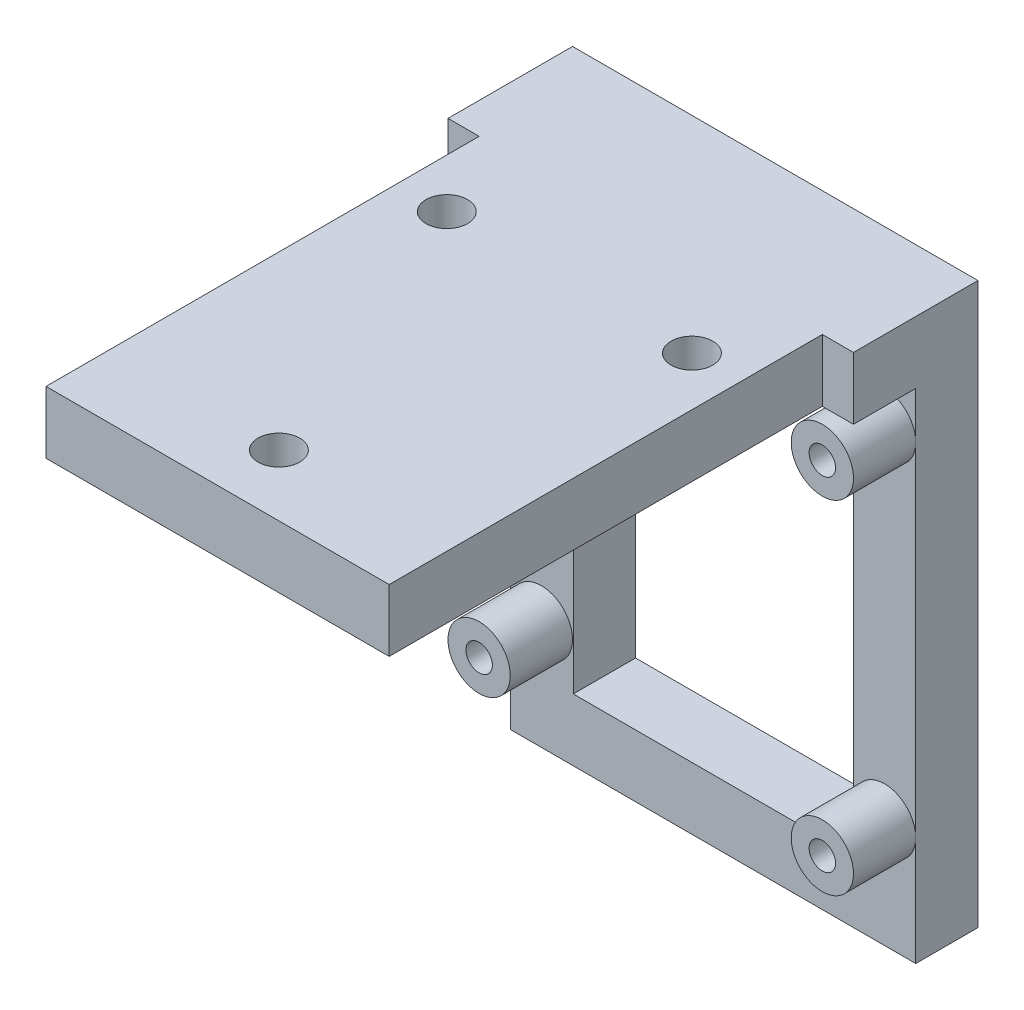
ISO-10303-21;
HEADER;
FILE_DESCRIPTION(('STEP AP214'),'2;1');
FILE_NAME('part.step','',(''),(''),'','','');
FILE_SCHEMA(('AUTOMOTIVE_DESIGN { 1 0 10303 214 1 1 1 1 }'));
ENDSEC;
DATA;
#1=APPLICATION_CONTEXT('core data for automotive mechanical design processes');
#2=APPLICATION_PROTOCOL_DEFINITION('international standard','automotive_design',2000,#1);
#3=PRODUCT_CONTEXT('',#1,'mechanical');
#4=PRODUCT('Part','Part','',(#3));
#5=PRODUCT_RELATED_PRODUCT_CATEGORY('part','',(#4));
#6=PRODUCT_DEFINITION_FORMATION('','',#4);
#7=PRODUCT_DEFINITION_CONTEXT('part definition',#1,'design');
#8=PRODUCT_DEFINITION('design','',#6,#7);
#9=PRODUCT_DEFINITION_SHAPE('','',#8);
#10=(LENGTH_UNIT() NAMED_UNIT(*) SI_UNIT(.MILLI.,.METRE.));
#11=(NAMED_UNIT(*) PLANE_ANGLE_UNIT() SI_UNIT($,.RADIAN.));
#12=(NAMED_UNIT(*) SI_UNIT($,.STERADIAN.) SOLID_ANGLE_UNIT());
#13=UNCERTAINTY_MEASURE_WITH_UNIT(LENGTH_MEASURE(1.E-05),#10,'distance_accuracy_value','');
#14=(GEOMETRIC_REPRESENTATION_CONTEXT(3) GLOBAL_UNCERTAINTY_ASSIGNED_CONTEXT((#13)) GLOBAL_UNIT_ASSIGNED_CONTEXT((#10,
#11,#12)) REPRESENTATION_CONTEXT('',''));
#15=CARTESIAN_POINT('',(0.,0.,0.));
#16=DIRECTION('',(0.,0.,1.));
#17=DIRECTION('',(1.,0.,0.));
#18=AXIS2_PLACEMENT_3D('',#15,#16,#17);
#19=CARTESIAN_POINT('',(33.08,-40.64,-40.42));
#20=DIRECTION('',(0.,0.,-1.));
#21=DIRECTION('',(-1.,0.,0.));
#22=AXIS2_PLACEMENT_3D('',#19,#20,#21);
#23=PLANE('',#22);
#24=DIRECTION('',(0.,1.,0.));
#25=VECTOR('',#24,1.);
#26=CARTESIAN_POINT('',(0.,-40.64,-40.42));
#27=LINE('',#26,#25);
#28=CARTESIAN_POINT('',(0.,-31.75,-40.42));
#29=VERTEX_POINT('',#28);
#30=CARTESIAN_POINT('',(0.,-3.81,-40.42));
#31=VERTEX_POINT('',#30);
#32=EDGE_CURVE('E331',#29,#31,#27,.T.);
#33=ORIENTED_EDGE('',*,*,#32,.F.);
#34=CARTESIAN_POINT('',(2.54,-31.75,-40.42));
#35=DIRECTION('',(0.,0.,1.));
#36=DIRECTION('',(1.,0.,0.));
#37=AXIS2_PLACEMENT_3D('',#34,#35,#36);
#38=CIRCLE('',#37,2.54);
#39=EDGE_CURVE('E488',#29,#29,#38,.T.);
#40=ORIENTED_EDGE('',*,*,#39,.F.);
#41=CARTESIAN_POINT('',(0.,-40.64,-40.42));
#42=VERTEX_POINT('',#41);
#43=EDGE_CURVE('E327',#42,#29,#27,.T.);
#44=ORIENTED_EDGE('',*,*,#43,.F.);
#45=DIRECTION('',(-1.,0.,0.));
#46=VECTOR('',#45,1.);
#47=CARTESIAN_POINT('',(33.08,-40.64,-40.42));
#48=LINE('',#47,#46);
#49=CARTESIAN_POINT('',(33.08,-40.64,-40.42));
#50=VERTEX_POINT('',#49);
#51=EDGE_CURVE('E311',#50,#42,#48,.T.);
#52=ORIENTED_EDGE('',*,*,#51,.F.);
#53=DIRECTION('',(0.,1.,0.));
#54=VECTOR('',#53,1.);
#55=CARTESIAN_POINT('',(33.08,-40.64,-40.42));
#56=LINE('',#55,#54);
#57=CARTESIAN_POINT('',(33.08,-31.75,-40.42));
#58=VERTEX_POINT('',#57);
#59=EDGE_CURVE('E249',#50,#58,#56,.T.);
#60=ORIENTED_EDGE('',*,*,#59,.T.);
#61=CARTESIAN_POINT('',(30.54,-31.75,-40.42));
#62=DIRECTION('',(0.,0.,1.));
#63=DIRECTION('',(1.,0.,0.));
#64=AXIS2_PLACEMENT_3D('',#61,#62,#63);
#65=CIRCLE('',#64,2.54);
#66=CARTESIAN_POINT('',(28.,-31.75,-40.42));
#67=VERTEX_POINT('',#66);
#68=EDGE_CURVE('E246',#67,#58,#65,.T.);
#69=ORIENTED_EDGE('',*,*,#68,.F.);
#70=DIRECTION('',(0.,-1.,0.));
#71=VECTOR('',#70,1.);
#72=CARTESIAN_POINT('',(28.,-40.64,-40.42));
#73=LINE('',#72,#71);
#74=CARTESIAN_POINT('',(28.,-35.56,-40.42));
#75=VERTEX_POINT('',#74);
#76=EDGE_CURVE('E51',#67,#75,#73,.T.);
#77=ORIENTED_EDGE('',*,*,#76,.T.);
#78=DIRECTION('',(-1.,0.,0.));
#79=VECTOR('',#78,1.);
#80=CARTESIAN_POINT('',(33.08,-35.56,-40.42));
#81=LINE('',#80,#79);
#82=CARTESIAN_POINT('',(5.14,-35.56,-40.42));
#83=VERTEX_POINT('',#82);
#84=EDGE_CURVE('E218',#75,#83,#81,.T.);
#85=ORIENTED_EDGE('',*,*,#84,.T.);
#86=DIRECTION('',(0.,1.,0.));
#87=VECTOR('',#86,1.);
#88=CARTESIAN_POINT('',(5.14,-40.64,-40.42));
#89=LINE('',#88,#87);
#90=CARTESIAN_POINT('',(5.14,0.,-40.42));
#91=VERTEX_POINT('',#90);
#92=EDGE_CURVE('E215',#83,#91,#89,.T.);
#93=ORIENTED_EDGE('',*,*,#92,.T.);
#94=DIRECTION('',(-1.,0.,0.));
#95=VECTOR('',#94,1.);
#96=CARTESIAN_POINT('',(33.08,0.,-40.42));
#97=LINE('',#96,#95);
#98=CARTESIAN_POINT('',(0.,0.,-40.42));
#99=VERTEX_POINT('',#98);
#100=EDGE_CURVE('E297',#91,#99,#97,.T.);
#101=ORIENTED_EDGE('',*,*,#100,.T.);
#102=EDGE_CURVE('E323',#31,#99,#27,.T.);
#103=ORIENTED_EDGE('',*,*,#102,.F.);
#104=CARTESIAN_POINT('',(2.54,-3.81,-40.42));
#105=DIRECTION('',(0.,0.,1.));
#106=DIRECTION('',(1.,0.,0.));
#107=AXIS2_PLACEMENT_3D('',#104,#105,#106);
#108=CIRCLE('',#107,2.54);
#109=EDGE_CURVE('E490',#31,#31,#108,.T.);
#110=ORIENTED_EDGE('',*,*,#109,.F.);
#111=EDGE_LOOP('',(#33,#40,#44,#52,#60,#69,#77,#85,#93,#101,#103,#110));
#112=FACE_BOUND('',#111,.T.);
#113=ADVANCED_FACE('F41',(#112),#23,.F.);
#114=CARTESIAN_POINT('',(30.54,-3.81,-40.42));
#115=DIRECTION('',(0.,0.,1.));
#116=DIRECTION('',(1.,0.,0.));
#117=AXIS2_PLACEMENT_3D('',#114,#115,#116);
#118=CIRCLE('',#117,2.54);
#119=CARTESIAN_POINT('',(28.,-3.81,-40.42));
#120=VERTEX_POINT('',#119);
#121=CARTESIAN_POINT('',(33.08,-3.81,-40.42));
#122=VERTEX_POINT('',#121);
#123=EDGE_CURVE('E236',#120,#122,#118,.T.);
#124=ORIENTED_EDGE('',*,*,#123,.F.);
#125=EDGE_CURVE('E50',#120,#67,#73,.T.);
#126=ORIENTED_EDGE('',*,*,#125,.T.);
#127=EDGE_CURVE('E233',#58,#67,#65,.T.);
#128=ORIENTED_EDGE('',*,*,#127,.F.);
#129=EDGE_CURVE('E334',#58,#122,#56,.T.);
#130=ORIENTED_EDGE('',*,*,#129,.T.);
#131=EDGE_LOOP('',(#124,#126,#128,#130));
#132=FACE_BOUND('',#131,.T.);
#133=ADVANCED_FACE('F230',(#132),#23,.F.);
#134=EDGE_CURVE('E392',#122,#120,#118,.T.);
#135=ORIENTED_EDGE('',*,*,#134,.F.);
#136=CARTESIAN_POINT('',(33.08,0.,-40.42));
#137=VERTEX_POINT('',#136);
#138=EDGE_CURVE('E330',#122,#137,#56,.T.);
#139=ORIENTED_EDGE('',*,*,#138,.T.);
#140=CARTESIAN_POINT('',(28.,0.,-40.42));
#141=VERTEX_POINT('',#140);
#142=EDGE_CURVE('E312',#137,#141,#97,.T.);
#143=ORIENTED_EDGE('',*,*,#142,.T.);
#144=EDGE_CURVE('E11',#141,#120,#73,.T.);
#145=ORIENTED_EDGE('',*,*,#144,.T.);
#146=EDGE_LOOP('',(#135,#139,#143,#145));
#147=FACE_BOUND('',#146,.T.);
#148=ADVANCED_FACE('F379',(#147),#23,.F.);
#149=CARTESIAN_POINT('',(0.,5.08,0.));
#150=DIRECTION('',(1.,0.,0.));
#151=DIRECTION('',(0.,0.,-1.));
#152=AXIS2_PLACEMENT_3D('',#149,#150,#151);
#153=PLANE('',#152);
#154=DIRECTION('',(0.,0.,1.));
#155=VECTOR('',#154,1.);
#156=CARTESIAN_POINT('',(0.,0.,0.));
#157=LINE('',#156,#155);
#158=CARTESIAN_POINT('',(0.,0.,-35.34));
#159=VERTEX_POINT('',#158);
#160=EDGE_CURVE('E177',#99,#159,#157,.T.);
#161=ORIENTED_EDGE('',*,*,#160,.T.);
#162=DIRECTION('',(0.,-1.,0.));
#163=VECTOR('',#162,1.);
#164=CARTESIAN_POINT('',(0.,5.08,-35.34));
#165=LINE('',#164,#163);
#166=CARTESIAN_POINT('',(0.,5.08,-35.34));
#167=VERTEX_POINT('',#166);
#168=EDGE_CURVE('E58',#167,#159,#165,.T.);
#169=ORIENTED_EDGE('',*,*,#168,.F.);
#170=DIRECTION('',(0.,0.,1.));
#171=VECTOR('',#170,1.);
#172=CARTESIAN_POINT('',(0.,5.08,0.));
#173=LINE('',#172,#171);
#174=CARTESIAN_POINT('',(0.,5.08,-45.5));
#175=VERTEX_POINT('',#174);
#176=EDGE_CURVE('E175',#175,#167,#173,.T.);
#177=ORIENTED_EDGE('',*,*,#176,.F.);
#178=DIRECTION('',(0.,-1.,0.));
#179=VECTOR('',#178,1.);
#180=CARTESIAN_POINT('',(0.,5.08,-45.5));
#181=LINE('',#180,#179);
#182=CARTESIAN_POINT('',(0.,-40.64,-45.5));
#183=VERTEX_POINT('',#182);
#184=EDGE_CURVE('E203',#175,#183,#181,.T.);
#185=ORIENTED_EDGE('',*,*,#184,.T.);
#186=DIRECTION('',(0.,0.,-1.));
#187=VECTOR('',#186,1.);
#188=CARTESIAN_POINT('',(0.,-40.64,-45.5));
#189=LINE('',#188,#187);
#190=EDGE_CURVE('E315',#42,#183,#189,.T.);
#191=ORIENTED_EDGE('',*,*,#190,.F.);
#192=ORIENTED_EDGE('',*,*,#43,.T.);
#193=ORIENTED_EDGE('',*,*,#32,.T.);
#194=ORIENTED_EDGE('',*,*,#102,.T.);
#195=EDGE_LOOP('',(#161,#169,#177,#185,#191,#192,#193,#194));
#196=FACE_BOUND('',#195,.T.);
#197=ADVANCED_FACE('F43',(#196),#153,.F.);
#198=CARTESIAN_POINT('',(0.,5.08,0.));
#199=DIRECTION('',(0.,0.,-1.));
#200=DIRECTION('',(-1.,0.,0.));
#201=AXIS2_PLACEMENT_3D('',#198,#199,#200);
#202=PLANE('',#201);
#203=DIRECTION('',(1.,0.,0.));
#204=VECTOR('',#203,1.);
#205=CARTESIAN_POINT('',(0.,5.08,0.));
#206=LINE('',#205,#204);
#207=CARTESIAN_POINT('',(2.54,5.08,0.));
#208=VERTEX_POINT('',#207);
#209=CARTESIAN_POINT('',(30.54,5.08,0.));
#210=VERTEX_POINT('',#209);
#211=EDGE_CURVE('E185',#208,#210,#206,.T.);
#212=ORIENTED_EDGE('',*,*,#211,.F.);
#213=DIRECTION('',(0.,-1.,0.));
#214=VECTOR('',#213,1.);
#215=CARTESIAN_POINT('',(2.54,5.08,0.));
#216=LINE('',#215,#214);
#217=CARTESIAN_POINT('',(2.54,0.,0.));
#218=VERTEX_POINT('',#217);
#219=EDGE_CURVE('E509',#208,#218,#216,.T.);
#220=ORIENTED_EDGE('',*,*,#219,.T.);
#221=DIRECTION('',(1.,0.,0.));
#222=VECTOR('',#221,1.);
#223=CARTESIAN_POINT('',(0.,0.,0.));
#224=LINE('',#223,#222);
#225=CARTESIAN_POINT('',(30.54,0.,0.));
#226=VERTEX_POINT('',#225);
#227=EDGE_CURVE('E193',#218,#226,#224,.T.);
#228=ORIENTED_EDGE('',*,*,#227,.T.);
#229=DIRECTION('',(0.,-1.,0.));
#230=VECTOR('',#229,1.);
#231=CARTESIAN_POINT('',(30.54,5.08,0.));
#232=LINE('',#231,#230);
#233=EDGE_CURVE('E66',#210,#226,#232,.T.);
#234=ORIENTED_EDGE('',*,*,#233,.F.);
#235=EDGE_LOOP('',(#212,#220,#228,#234));
#236=FACE_BOUND('',#235,.T.);
#237=ADVANCED_FACE('F390',(#236),#202,.F.);
#238=CARTESIAN_POINT('',(33.08,5.08,0.));
#239=DIRECTION('',(-1.,0.,0.));
#240=DIRECTION('',(0.,0.,1.));
#241=AXIS2_PLACEMENT_3D('',#238,#239,#240);
#242=PLANE('',#241);
#243=DIRECTION('',(0.,0.,-1.));
#244=VECTOR('',#243,1.);
#245=CARTESIAN_POINT('',(33.08,5.08,0.));
#246=LINE('',#245,#244);
#247=CARTESIAN_POINT('',(33.08,5.08,-35.34));
#248=VERTEX_POINT('',#247);
#249=CARTESIAN_POINT('',(33.08,5.08,-45.5));
#250=VERTEX_POINT('',#249);
#251=EDGE_CURVE('E191',#248,#250,#246,.T.);
#252=ORIENTED_EDGE('',*,*,#251,.F.);
#253=DIRECTION('',(0.,-1.,0.));
#254=VECTOR('',#253,1.);
#255=CARTESIAN_POINT('',(33.08,5.08,-35.34));
#256=LINE('',#255,#254);
#257=CARTESIAN_POINT('',(33.08,0.,-35.34));
#258=VERTEX_POINT('',#257);
#259=EDGE_CURVE('E500',#248,#258,#256,.T.);
#260=ORIENTED_EDGE('',*,*,#259,.T.);
#261=DIRECTION('',(0.,0.,-1.));
#262=VECTOR('',#261,1.);
#263=CARTESIAN_POINT('',(33.08,0.,0.));
#264=LINE('',#263,#262);
#265=EDGE_CURVE('E186',#258,#137,#264,.T.);
#266=ORIENTED_EDGE('',*,*,#265,.T.);
#267=ORIENTED_EDGE('',*,*,#138,.F.);
#268=ORIENTED_EDGE('',*,*,#129,.F.);
#269=ORIENTED_EDGE('',*,*,#59,.F.);
#270=DIRECTION('',(0.,0.,1.));
#271=VECTOR('',#270,1.);
#272=CARTESIAN_POINT('',(33.08,-40.64,-45.5));
#273=LINE('',#272,#271);
#274=CARTESIAN_POINT('',(33.08,-40.64,-45.5));
#275=VERTEX_POINT('',#274);
#276=EDGE_CURVE('E307',#275,#50,#273,.T.);
#277=ORIENTED_EDGE('',*,*,#276,.F.);
#278=DIRECTION('',(0.,-1.,0.));
#279=VECTOR('',#278,1.);
#280=CARTESIAN_POINT('',(33.08,5.08,-45.5));
#281=LINE('',#280,#279);
#282=EDGE_CURVE('E212',#250,#275,#281,.T.);
#283=ORIENTED_EDGE('',*,*,#282,.F.);
#284=EDGE_LOOP('',(#252,#260,#266,#267,#268,#269,#277,#283));
#285=FACE_BOUND('',#284,.T.);
#286=ADVANCED_FACE('F401',(#285),#242,.F.);
#287=CARTESIAN_POINT('',(0.,5.08,-45.5));
#288=DIRECTION('',(0.,0.,1.));
#289=DIRECTION('',(1.,0.,0.));
#290=AXIS2_PLACEMENT_3D('',#287,#288,#289);
#291=PLANE('',#290);
#292=CARTESIAN_POINT('',(2.54,-3.81,-45.5));
#293=DIRECTION('',(0.,0.,1.));
#294=DIRECTION('',(1.,0.,0.));
#295=AXIS2_PLACEMENT_3D('',#292,#293,#294);
#296=CIRCLE('',#295,1.0795);
#297=CARTESIAN_POINT('',(3.6195,-3.81,-45.5));
#298=VERTEX_POINT('',#297);
#299=EDGE_CURVE('E259',#298,#298,#296,.T.);
#300=ORIENTED_EDGE('',*,*,#299,.T.);
#301=EDGE_LOOP('',(#300));
#302=FACE_BOUND('',#301,.T.);
#303=CARTESIAN_POINT('',(30.54,-3.81,-45.5));
#304=DIRECTION('',(0.,0.,1.));
#305=DIRECTION('',(1.,0.,0.));
#306=AXIS2_PLACEMENT_3D('',#303,#304,#305);
#307=CIRCLE('',#306,1.0795);
#308=CARTESIAN_POINT('',(31.6195,-3.81,-45.5));
#309=VERTEX_POINT('',#308);
#310=EDGE_CURVE('E272',#309,#309,#307,.T.);
#311=ORIENTED_EDGE('',*,*,#310,.T.);
#312=EDGE_LOOP('',(#311));
#313=FACE_BOUND('',#312,.T.);
#314=CARTESIAN_POINT('',(2.54,-31.75,-45.5));
#315=DIRECTION('',(0.,0.,1.));
#316=DIRECTION('',(1.,0.,0.));
#317=AXIS2_PLACEMENT_3D('',#314,#315,#316);
#318=CIRCLE('',#317,1.0795);
#319=CARTESIAN_POINT('',(3.6195,-31.75,-45.5));
#320=VERTEX_POINT('',#319);
#321=EDGE_CURVE('E268',#320,#320,#318,.T.);
#322=ORIENTED_EDGE('',*,*,#321,.T.);
#323=EDGE_LOOP('',(#322));
#324=FACE_BOUND('',#323,.T.);
#325=CARTESIAN_POINT('',(30.54,-31.75,-45.5));
#326=DIRECTION('',(0.,0.,1.));
#327=DIRECTION('',(1.,0.,0.));
#328=AXIS2_PLACEMENT_3D('',#325,#326,#327);
#329=CIRCLE('',#328,1.0795);
#330=CARTESIAN_POINT('',(31.6195,-31.75,-45.5));
#331=VERTEX_POINT('',#330);
#332=EDGE_CURVE('E263',#331,#331,#329,.T.);
#333=ORIENTED_EDGE('',*,*,#332,.T.);
#334=EDGE_LOOP('',(#333));
#335=FACE_BOUND('',#334,.T.);
#336=DIRECTION('',(1.,0.,0.));
#337=VECTOR('',#336,1.);
#338=CARTESIAN_POINT('',(28.,-35.56,-45.5));
#339=LINE('',#338,#337);
#340=CARTESIAN_POINT('',(5.14,-35.56,-45.5));
#341=VERTEX_POINT('',#340);
#342=CARTESIAN_POINT('',(28.,-35.56,-45.5));
#343=VERTEX_POINT('',#342);
#344=EDGE_CURVE('E290',#341,#343,#339,.T.);
#345=ORIENTED_EDGE('',*,*,#344,.T.);
#346=DIRECTION('',(0.,1.,0.));
#347=VECTOR('',#346,1.);
#348=CARTESIAN_POINT('',(28.,-35.56,-45.5));
#349=LINE('',#348,#347);
#350=CARTESIAN_POINT('',(28.,0.,-45.5));
#351=VERTEX_POINT('',#350);
#352=EDGE_CURVE('E267',#343,#351,#349,.T.);
#353=ORIENTED_EDGE('',*,*,#352,.T.);
#354=DIRECTION('',(-1.,0.,0.));
#355=VECTOR('',#354,1.);
#356=CARTESIAN_POINT('',(28.,0.,-45.5));
#357=LINE('',#356,#355);
#358=CARTESIAN_POINT('',(5.14,0.,-45.5));
#359=VERTEX_POINT('',#358);
#360=EDGE_CURVE('E282',#351,#359,#357,.T.);
#361=ORIENTED_EDGE('',*,*,#360,.T.);
#362=DIRECTION('',(0.,-1.,0.));
#363=VECTOR('',#362,1.);
#364=CARTESIAN_POINT('',(5.14,-35.56,-45.5));
#365=LINE('',#364,#363);
#366=EDGE_CURVE('E286',#359,#341,#365,.T.);
#367=ORIENTED_EDGE('',*,*,#366,.T.);
#368=EDGE_LOOP('',(#345,#353,#361,#367));
#369=FACE_BOUND('',#368,.T.);
#370=ORIENTED_EDGE('',*,*,#282,.T.);
#371=DIRECTION('',(1.,0.,0.));
#372=VECTOR('',#371,1.);
#373=CARTESIAN_POINT('',(33.08,-40.64,-45.5));
#374=LINE('',#373,#372);
#375=EDGE_CURVE('E319',#183,#275,#374,.T.);
#376=ORIENTED_EDGE('',*,*,#375,.F.);
#377=ORIENTED_EDGE('',*,*,#184,.F.);
#378=DIRECTION('',(-1.,0.,0.));
#379=VECTOR('',#378,1.);
#380=CARTESIAN_POINT('',(0.,5.08,-45.5));
#381=LINE('',#380,#379);
#382=EDGE_CURVE('E182',#250,#175,#381,.T.);
#383=ORIENTED_EDGE('',*,*,#382,.F.);
#384=EDGE_LOOP('',(#370,#376,#377,#383));
#385=FACE_BOUND('',#384,.T.);
#386=ADVANCED_FACE('F371',(#302,#313,#324,#335,#369,#385),#291,.F.);
#387=CARTESIAN_POINT('',(0.,5.08,0.));
#388=DIRECTION('',(0.,-1.,0.));
#389=DIRECTION('',(0.,0.,-1.));
#390=AXIS2_PLACEMENT_3D('',#387,#388,#389);
#391=PLANE('',#390);
#392=CARTESIAN_POINT('',(6.54,5.08,-28.7));
#393=DIRECTION('',(0.,-1.,0.));
#394=DIRECTION('',(0.,0.,-1.));
#395=AXIS2_PLACEMENT_3D('',#392,#393,#394);
#396=CIRCLE('',#395,1.7);
#397=CARTESIAN_POINT('',(6.54,5.08,-30.4));
#398=VERTEX_POINT('',#397);
#399=EDGE_CURVE('E206',#398,#398,#396,.T.);
#400=ORIENTED_EDGE('',*,*,#399,.T.);
#401=EDGE_LOOP('',(#400));
#402=FACE_BOUND('',#401,.T.);
#403=CARTESIAN_POINT('',(26.54,5.08,-28.7));
#404=DIRECTION('',(0.,-1.,0.));
#405=DIRECTION('',(0.,0.,-1.));
#406=AXIS2_PLACEMENT_3D('',#403,#404,#405);
#407=CIRCLE('',#406,1.7);
#408=CARTESIAN_POINT('',(26.54,5.08,-30.4));
#409=VERTEX_POINT('',#408);
#410=EDGE_CURVE('E342',#409,#409,#407,.T.);
#411=ORIENTED_EDGE('',*,*,#410,.T.);
#412=EDGE_LOOP('',(#411));
#413=FACE_BOUND('',#412,.T.);
#414=CARTESIAN_POINT('',(16.54,5.08,-5.));
#415=DIRECTION('',(0.,-1.,0.));
#416=DIRECTION('',(0.,0.,-1.));
#417=AXIS2_PLACEMENT_3D('',#414,#415,#416);
#418=CIRCLE('',#417,1.7);
#419=CARTESIAN_POINT('',(16.54,5.08,-6.7));
#420=VERTEX_POINT('',#419);
#421=EDGE_CURVE('E349',#420,#420,#418,.T.);
#422=ORIENTED_EDGE('',*,*,#421,.T.);
#423=EDGE_LOOP('',(#422));
#424=FACE_BOUND('',#423,.T.);
#425=DIRECTION('',(1.,0.,0.));
#426=VECTOR('',#425,1.);
#427=CARTESIAN_POINT('',(0.,5.08,-35.34));
#428=LINE('',#427,#426);
#429=CARTESIAN_POINT('',(2.54,5.08,-35.34));
#430=VERTEX_POINT('',#429);
#431=EDGE_CURVE('E161',#167,#430,#428,.T.);
#432=ORIENTED_EDGE('',*,*,#431,.T.);
#433=DIRECTION('',(0.,0.,1.));
#434=VECTOR('',#433,1.);
#435=CARTESIAN_POINT('',(2.54,5.08,0.));
#436=LINE('',#435,#434);
#437=EDGE_CURVE('E169',#430,#208,#436,.T.);
#438=ORIENTED_EDGE('',*,*,#437,.T.);
#439=ORIENTED_EDGE('',*,*,#211,.T.);
#440=DIRECTION('',(0.,0.,-1.));
#441=VECTOR('',#440,1.);
#442=CARTESIAN_POINT('',(30.54,5.08,0.));
#443=LINE('',#442,#441);
#444=CARTESIAN_POINT('',(30.54,5.08,-35.34));
#445=VERTEX_POINT('',#444);
#446=EDGE_CURVE('E516',#210,#445,#443,.T.);
#447=ORIENTED_EDGE('',*,*,#446,.T.);
#448=DIRECTION('',(1.,0.,0.));
#449=VECTOR('',#448,1.);
#450=CARTESIAN_POINT('',(33.08,5.08,-35.34));
#451=LINE('',#450,#449);
#452=EDGE_CURVE('E520',#445,#248,#451,.T.);
#453=ORIENTED_EDGE('',*,*,#452,.T.);
#454=ORIENTED_EDGE('',*,*,#251,.T.);
#455=ORIENTED_EDGE('',*,*,#382,.T.);
#456=ORIENTED_EDGE('',*,*,#176,.T.);
#457=EDGE_LOOP('',(#432,#438,#439,#447,#453,#454,#455,#456));
#458=FACE_BOUND('',#457,.T.);
#459=ADVANCED_FACE('F180',(#402,#413,#424,#458),#391,.F.);
#460=CARTESIAN_POINT('',(0.,0.,0.));
#461=DIRECTION('',(0.,-1.,0.));
#462=DIRECTION('',(0.,0.,-1.));
#463=AXIS2_PLACEMENT_3D('',#460,#461,#462);
#464=PLANE('',#463);
#465=DIRECTION('',(0.,0.,1.));
#466=VECTOR('',#465,1.);
#467=CARTESIAN_POINT('',(2.54,0.,0.));
#468=LINE('',#467,#466);
#469=CARTESIAN_POINT('',(2.54,0.,-35.34));
#470=VERTEX_POINT('',#469);
#471=EDGE_CURVE('E170',#470,#218,#468,.T.);
#472=ORIENTED_EDGE('',*,*,#471,.F.);
#473=DIRECTION('',(1.,0.,0.));
#474=VECTOR('',#473,1.);
#475=CARTESIAN_POINT('',(0.,0.,-35.34));
#476=LINE('',#475,#474);
#477=EDGE_CURVE('E497',#159,#470,#476,.T.);
#478=ORIENTED_EDGE('',*,*,#477,.F.);
#479=ORIENTED_EDGE('',*,*,#160,.F.);
#480=ORIENTED_EDGE('',*,*,#100,.F.);
#481=DIRECTION('',(0.,0.,1.));
#482=VECTOR('',#481,1.);
#483=CARTESIAN_POINT('',(5.14,0.,-45.5));
#484=LINE('',#483,#482);
#485=EDGE_CURVE('E302',#359,#91,#484,.T.);
#486=ORIENTED_EDGE('',*,*,#485,.F.);
#487=ORIENTED_EDGE('',*,*,#360,.F.);
#488=DIRECTION('',(0.,0.,1.));
#489=VECTOR('',#488,1.);
#490=CARTESIAN_POINT('',(28.,0.,-45.5));
#491=LINE('',#490,#489);
#492=EDGE_CURVE('E294',#351,#141,#491,.T.);
#493=ORIENTED_EDGE('',*,*,#492,.T.);
#494=ORIENTED_EDGE('',*,*,#142,.F.);
#495=ORIENTED_EDGE('',*,*,#265,.F.);
#496=DIRECTION('',(1.,0.,0.));
#497=VECTOR('',#496,1.);
#498=CARTESIAN_POINT('',(33.08,0.,-35.34));
#499=LINE('',#498,#497);
#500=CARTESIAN_POINT('',(30.54,0.,-35.34));
#501=VERTEX_POINT('',#500);
#502=EDGE_CURVE('E521',#501,#258,#499,.T.);
#503=ORIENTED_EDGE('',*,*,#502,.F.);
#504=DIRECTION('',(0.,0.,-1.));
#505=VECTOR('',#504,1.);
#506=CARTESIAN_POINT('',(30.54,0.,0.));
#507=LINE('',#506,#505);
#508=EDGE_CURVE('E525',#226,#501,#507,.T.);
#509=ORIENTED_EDGE('',*,*,#508,.F.);
#510=ORIENTED_EDGE('',*,*,#227,.F.);
#511=EDGE_LOOP('',(#472,#478,#479,#480,#486,#487,#493,#494,#495,#503,#509,#510));
#512=FACE_BOUND('',#511,.T.);
#513=CARTESIAN_POINT('',(26.54,0.,-28.7));
#514=DIRECTION('',(0.,-1.,0.));
#515=DIRECTION('',(0.,0.,-1.));
#516=AXIS2_PLACEMENT_3D('',#513,#514,#515);
#517=CIRCLE('',#516,1.7);
#518=CARTESIAN_POINT('',(26.54,0.,-30.4));
#519=VERTEX_POINT('',#518);
#520=EDGE_CURVE('E346',#519,#519,#517,.T.);
#521=ORIENTED_EDGE('',*,*,#520,.F.);
#522=EDGE_LOOP('',(#521));
#523=FACE_BOUND('',#522,.T.);
#524=CARTESIAN_POINT('',(6.54,0.,-28.7));
#525=DIRECTION('',(0.,-1.,0.));
#526=DIRECTION('',(0.,0.,-1.));
#527=AXIS2_PLACEMENT_3D('',#524,#525,#526);
#528=CIRCLE('',#527,1.7);
#529=CARTESIAN_POINT('',(6.54,0.,-30.4));
#530=VERTEX_POINT('',#529);
#531=EDGE_CURVE('E338',#530,#530,#528,.T.);
#532=ORIENTED_EDGE('',*,*,#531,.F.);
#533=EDGE_LOOP('',(#532));
#534=FACE_BOUND('',#533,.T.);
#535=CARTESIAN_POINT('',(16.54,0.,-5.));
#536=DIRECTION('',(0.,-1.,0.));
#537=DIRECTION('',(0.,0.,-1.));
#538=AXIS2_PLACEMENT_3D('',#535,#536,#537);
#539=CIRCLE('',#538,1.7);
#540=CARTESIAN_POINT('',(16.54,0.,-6.7));
#541=VERTEX_POINT('',#540);
#542=EDGE_CURVE('E196',#541,#541,#539,.T.);
#543=ORIENTED_EDGE('',*,*,#542,.F.);
#544=EDGE_LOOP('',(#543));
#545=FACE_BOUND('',#544,.T.);
#546=ADVANCED_FACE('F360',(#512,#523,#534,#545),#464,.T.);
#547=CARTESIAN_POINT('',(16.54,5.08,-5.));
#548=DIRECTION('',(0.,-1.,0.));
#549=DIRECTION('',(0.,0.,-1.));
#550=AXIS2_PLACEMENT_3D('',#547,#548,#549);
#551=CYLINDRICAL_SURFACE('',#550,1.7);
#552=ORIENTED_EDGE('',*,*,#421,.F.);
#553=EDGE_LOOP('',(#552));
#554=FACE_BOUND('',#553,.T.);
#555=ORIENTED_EDGE('',*,*,#542,.T.);
#556=EDGE_LOOP('',(#555));
#557=FACE_BOUND('',#556,.T.);
#558=ADVANCED_FACE('F358',(#554,#557),#551,.F.);
#559=CARTESIAN_POINT('',(26.54,5.08,-28.7));
#560=DIRECTION('',(0.,-1.,0.));
#561=DIRECTION('',(0.,0.,-1.));
#562=AXIS2_PLACEMENT_3D('',#559,#560,#561);
#563=CYLINDRICAL_SURFACE('',#562,1.7);
#564=ORIENTED_EDGE('',*,*,#410,.F.);
#565=EDGE_LOOP('',(#564));
#566=FACE_BOUND('',#565,.T.);
#567=ORIENTED_EDGE('',*,*,#520,.T.);
#568=EDGE_LOOP('',(#567));
#569=FACE_BOUND('',#568,.T.);
#570=ADVANCED_FACE('F368',(#566,#569),#563,.F.);
#571=CARTESIAN_POINT('',(6.54,5.08,-28.7));
#572=DIRECTION('',(0.,-1.,0.));
#573=DIRECTION('',(0.,0.,-1.));
#574=AXIS2_PLACEMENT_3D('',#571,#572,#573);
#575=CYLINDRICAL_SURFACE('',#574,1.7);
#576=ORIENTED_EDGE('',*,*,#399,.F.);
#577=EDGE_LOOP('',(#576));
#578=FACE_BOUND('',#577,.T.);
#579=ORIENTED_EDGE('',*,*,#531,.T.);
#580=EDGE_LOOP('',(#579));
#581=FACE_BOUND('',#580,.T.);
#582=ADVANCED_FACE('F472',(#578,#581),#575,.F.);
#583=CARTESIAN_POINT('',(0.,-40.64,0.));
#584=DIRECTION('',(0.,-1.,0.));
#585=DIRECTION('',(0.,0.,-1.));
#586=AXIS2_PLACEMENT_3D('',#583,#584,#585);
#587=PLANE('',#586);
#588=ORIENTED_EDGE('',*,*,#276,.T.);
#589=ORIENTED_EDGE('',*,*,#51,.T.);
#590=ORIENTED_EDGE('',*,*,#190,.T.);
#591=ORIENTED_EDGE('',*,*,#375,.T.);
#592=EDGE_LOOP('',(#588,#589,#590,#591));
#593=FACE_BOUND('',#592,.T.);
#594=ADVANCED_FACE('F470',(#593),#587,.T.);
#595=CARTESIAN_POINT('',(28.,-35.56,-45.5));
#596=DIRECTION('',(1.,0.,0.));
#597=DIRECTION('',(0.,1.,0.));
#598=AXIS2_PLACEMENT_3D('',#595,#596,#597);
#599=PLANE('',#598);
#600=ORIENTED_EDGE('',*,*,#492,.F.);
#601=ORIENTED_EDGE('',*,*,#352,.F.);
#602=DIRECTION('',(0.,0.,1.));
#603=VECTOR('',#602,1.);
#604=CARTESIAN_POINT('',(28.,-35.56,-45.5));
#605=LINE('',#604,#603);
#606=EDGE_CURVE('E243',#343,#75,#605,.T.);
#607=ORIENTED_EDGE('',*,*,#606,.T.);
#608=ORIENTED_EDGE('',*,*,#76,.F.);
#609=ORIENTED_EDGE('',*,*,#125,.F.);
#610=ORIENTED_EDGE('',*,*,#144,.F.);
#611=EDGE_LOOP('',(#600,#601,#607,#608,#609,#610));
#612=FACE_BOUND('',#611,.T.);
#613=ADVANCED_FACE('F241',(#612),#599,.F.);
#614=CARTESIAN_POINT('',(28.,-35.56,-45.5));
#615=DIRECTION('',(0.,-1.,0.));
#616=DIRECTION('',(1.,0.,0.));
#617=AXIS2_PLACEMENT_3D('',#614,#615,#616);
#618=PLANE('',#617);
#619=ORIENTED_EDGE('',*,*,#606,.F.);
#620=ORIENTED_EDGE('',*,*,#344,.F.);
#621=DIRECTION('',(0.,0.,1.));
#622=VECTOR('',#621,1.);
#623=CARTESIAN_POINT('',(5.14,-35.56,-45.5));
#624=LINE('',#623,#622);
#625=EDGE_CURVE('E298',#341,#83,#624,.T.);
#626=ORIENTED_EDGE('',*,*,#625,.T.);
#627=ORIENTED_EDGE('',*,*,#84,.F.);
#628=EDGE_LOOP('',(#619,#620,#626,#627));
#629=FACE_BOUND('',#628,.T.);
#630=ADVANCED_FACE('F462',(#629),#618,.F.);
#631=CARTESIAN_POINT('',(5.14,-35.56,-45.5));
#632=DIRECTION('',(-1.,0.,0.));
#633=DIRECTION('',(0.,0.,1.));
#634=AXIS2_PLACEMENT_3D('',#631,#632,#633);
#635=PLANE('',#634);
#636=ORIENTED_EDGE('',*,*,#625,.F.);
#637=ORIENTED_EDGE('',*,*,#366,.F.);
#638=ORIENTED_EDGE('',*,*,#485,.T.);
#639=ORIENTED_EDGE('',*,*,#92,.F.);
#640=EDGE_LOOP('',(#636,#637,#638,#639));
#641=FACE_BOUND('',#640,.T.);
#642=ADVANCED_FACE('F450',(#641),#635,.F.);
#643=CARTESIAN_POINT('',(30.54,-31.75,-45.5));
#644=DIRECTION('',(0.,0.,1.));
#645=DIRECTION('',(1.,0.,0.));
#646=AXIS2_PLACEMENT_3D('',#643,#644,#645);
#647=CYLINDRICAL_SURFACE('',#646,1.0795);
#648=ORIENTED_EDGE('',*,*,#332,.F.);
#649=EDGE_LOOP('',(#648));
#650=FACE_BOUND('',#649,.T.);
#651=CARTESIAN_POINT('',(30.54,-31.75,-35.34));
#652=DIRECTION('',(0.,0.,1.));
#653=DIRECTION('',(1.,0.,0.));
#654=AXIS2_PLACEMENT_3D('',#651,#652,#653);
#655=CIRCLE('',#654,1.0795);
#656=CARTESIAN_POINT('',(31.6195,-31.75,-35.34));
#657=VERTEX_POINT('',#656);
#658=EDGE_CURVE('E252',#657,#657,#655,.T.);
#659=ORIENTED_EDGE('',*,*,#658,.T.);
#660=EDGE_LOOP('',(#659));
#661=FACE_BOUND('',#660,.T.);
#662=ADVANCED_FACE('F446',(#650,#661),#647,.F.);
#663=CARTESIAN_POINT('',(2.54,-31.75,-45.5));
#664=DIRECTION('',(0.,0.,1.));
#665=DIRECTION('',(1.,0.,0.));
#666=AXIS2_PLACEMENT_3D('',#663,#664,#665);
#667=CYLINDRICAL_SURFACE('',#666,1.0795);
#668=ORIENTED_EDGE('',*,*,#321,.F.);
#669=EDGE_LOOP('',(#668));
#670=FACE_BOUND('',#669,.T.);
#671=CARTESIAN_POINT('',(2.54,-31.75,-35.34));
#672=DIRECTION('',(0.,0.,1.));
#673=DIRECTION('',(1.,0.,0.));
#674=AXIS2_PLACEMENT_3D('',#671,#672,#673);
#675=CIRCLE('',#674,1.0795);
#676=CARTESIAN_POINT('',(3.6195,-31.75,-35.34));
#677=VERTEX_POINT('',#676);
#678=EDGE_CURVE('E513',#677,#677,#675,.T.);
#679=ORIENTED_EDGE('',*,*,#678,.T.);
#680=EDGE_LOOP('',(#679));
#681=FACE_BOUND('',#680,.T.);
#682=ADVANCED_FACE('F449',(#670,#681),#667,.F.);
#683=CARTESIAN_POINT('',(30.54,-3.81,-45.5));
#684=DIRECTION('',(0.,0.,1.));
#685=DIRECTION('',(1.,0.,0.));
#686=AXIS2_PLACEMENT_3D('',#683,#684,#685);
#687=CYLINDRICAL_SURFACE('',#686,1.0795);
#688=ORIENTED_EDGE('',*,*,#310,.F.);
#689=EDGE_LOOP('',(#688));
#690=FACE_BOUND('',#689,.T.);
#691=CARTESIAN_POINT('',(30.54,-3.81,-35.34));
#692=DIRECTION('',(0.,0.,1.));
#693=DIRECTION('',(1.,0.,0.));
#694=AXIS2_PLACEMENT_3D('',#691,#692,#693);
#695=CIRCLE('',#694,1.0795);
#696=CARTESIAN_POINT('',(31.6195,-3.81,-35.34));
#697=VERTEX_POINT('',#696);
#698=EDGE_CURVE('E408',#697,#697,#695,.T.);
#699=ORIENTED_EDGE('',*,*,#698,.T.);
#700=EDGE_LOOP('',(#699));
#701=FACE_BOUND('',#700,.T.);
#702=ADVANCED_FACE('F454',(#690,#701),#687,.F.);
#703=CARTESIAN_POINT('',(2.54,-3.81,-45.5));
#704=DIRECTION('',(0.,0.,1.));
#705=DIRECTION('',(1.,0.,0.));
#706=AXIS2_PLACEMENT_3D('',#703,#704,#705);
#707=CYLINDRICAL_SURFACE('',#706,1.0795);
#708=ORIENTED_EDGE('',*,*,#299,.F.);
#709=EDGE_LOOP('',(#708));
#710=FACE_BOUND('',#709,.T.);
#711=CARTESIAN_POINT('',(2.54,-3.81,-35.34));
#712=DIRECTION('',(0.,0.,1.));
#713=DIRECTION('',(1.,0.,0.));
#714=AXIS2_PLACEMENT_3D('',#711,#712,#713);
#715=CIRCLE('',#714,1.0795);
#716=CARTESIAN_POINT('',(3.6195,-3.81,-35.34));
#717=VERTEX_POINT('',#716);
#718=EDGE_CURVE('E541',#717,#717,#715,.T.);
#719=ORIENTED_EDGE('',*,*,#718,.T.);
#720=EDGE_LOOP('',(#719));
#721=FACE_BOUND('',#720,.T.);
#722=ADVANCED_FACE('F441',(#710,#721),#707,.F.);
#723=CARTESIAN_POINT('',(30.54,-31.75,-35.34));
#724=DIRECTION('',(0.,0.,1.));
#725=DIRECTION('',(1.,0.,0.));
#726=AXIS2_PLACEMENT_3D('',#723,#724,#725);
#727=PLANE('',#726);
#728=CARTESIAN_POINT('',(30.54,-31.75,-35.34));
#729=DIRECTION('',(0.,0.,1.));
#730=DIRECTION('',(1.,0.,0.));
#731=AXIS2_PLACEMENT_3D('',#728,#729,#730);
#732=CIRCLE('',#731,2.54);
#733=CARTESIAN_POINT('',(33.08,-31.75,-35.34));
#734=VERTEX_POINT('',#733);
#735=EDGE_CURVE('E256',#734,#734,#732,.T.);
#736=ORIENTED_EDGE('',*,*,#735,.T.);
#737=EDGE_LOOP('',(#736));
#738=FACE_BOUND('',#737,.T.);
#739=ORIENTED_EDGE('',*,*,#658,.F.);
#740=EDGE_LOOP('',(#739));
#741=FACE_BOUND('',#740,.T.);
#742=ADVANCED_FACE('F438',(#738,#741),#727,.T.);
#743=CARTESIAN_POINT('',(30.54,-31.75,-35.34));
#744=DIRECTION('',(0.,0.,-1.));
#745=DIRECTION('',(-1.,0.,0.));
#746=AXIS2_PLACEMENT_3D('',#743,#744,#745);
#747=CYLINDRICAL_SURFACE('',#746,2.54);
#748=ORIENTED_EDGE('',*,*,#735,.F.);
#749=EDGE_LOOP('',(#748));
#750=FACE_BOUND('',#749,.T.);
#751=ORIENTED_EDGE('',*,*,#127,.T.);
#752=ORIENTED_EDGE('',*,*,#68,.T.);
#753=EDGE_LOOP('',(#751,#752));
#754=FACE_BOUND('',#753,.T.);
#755=ADVANCED_FACE('F254',(#750,#754),#747,.T.);
#756=CARTESIAN_POINT('',(30.54,-3.81,-35.34));
#757=DIRECTION('',(0.,0.,1.));
#758=DIRECTION('',(1.,0.,0.));
#759=AXIS2_PLACEMENT_3D('',#756,#757,#758);
#760=PLANE('',#759);
#761=CARTESIAN_POINT('',(30.54,-3.81,-35.34));
#762=DIRECTION('',(0.,0.,1.));
#763=DIRECTION('',(1.,0.,0.));
#764=AXIS2_PLACEMENT_3D('',#761,#762,#763);
#765=CIRCLE('',#764,2.54);
#766=CARTESIAN_POINT('',(33.08,-3.81,-35.34));
#767=VERTEX_POINT('',#766);
#768=EDGE_CURVE('E397',#767,#767,#765,.T.);
#769=ORIENTED_EDGE('',*,*,#768,.T.);
#770=EDGE_LOOP('',(#769));
#771=FACE_BOUND('',#770,.T.);
#772=ORIENTED_EDGE('',*,*,#698,.F.);
#773=EDGE_LOOP('',(#772));
#774=FACE_BOUND('',#773,.T.);
#775=ADVANCED_FACE('F422',(#771,#774),#760,.T.);
#776=CARTESIAN_POINT('',(30.54,-3.81,-35.34));
#777=DIRECTION('',(0.,0.,-1.));
#778=DIRECTION('',(-1.,0.,0.));
#779=AXIS2_PLACEMENT_3D('',#776,#777,#778);
#780=CYLINDRICAL_SURFACE('',#779,2.54);
#781=ORIENTED_EDGE('',*,*,#768,.F.);
#782=EDGE_LOOP('',(#781));
#783=FACE_BOUND('',#782,.T.);
#784=ORIENTED_EDGE('',*,*,#134,.T.);
#785=ORIENTED_EDGE('',*,*,#123,.T.);
#786=EDGE_LOOP('',(#784,#785));
#787=FACE_BOUND('',#786,.T.);
#788=ADVANCED_FACE('F406',(#783,#787),#780,.T.);
#789=CARTESIAN_POINT('',(2.54,-3.81,-35.34));
#790=DIRECTION('',(0.,0.,1.));
#791=DIRECTION('',(1.,0.,0.));
#792=AXIS2_PLACEMENT_3D('',#789,#790,#791);
#793=PLANE('',#792);
#794=CARTESIAN_POINT('',(2.54,-3.81,-35.34));
#795=DIRECTION('',(0.,0.,1.));
#796=DIRECTION('',(1.,0.,0.));
#797=AXIS2_PLACEMENT_3D('',#794,#795,#796);
#798=CIRCLE('',#797,2.54);
#799=CARTESIAN_POINT('',(5.08,-3.81,-35.34));
#800=VERTEX_POINT('',#799);
#801=EDGE_CURVE('E411',#800,#800,#798,.T.);
#802=ORIENTED_EDGE('',*,*,#801,.T.);
#803=EDGE_LOOP('',(#802));
#804=FACE_BOUND('',#803,.T.);
#805=ORIENTED_EDGE('',*,*,#718,.F.);
#806=EDGE_LOOP('',(#805));
#807=FACE_BOUND('',#806,.T.);
#808=ADVANCED_FACE('F426',(#804,#807),#793,.T.);
#809=CARTESIAN_POINT('',(2.54,-3.81,-35.34));
#810=DIRECTION('',(0.,0.,-1.));
#811=DIRECTION('',(-1.,0.,0.));
#812=AXIS2_PLACEMENT_3D('',#809,#810,#811);
#813=CYLINDRICAL_SURFACE('',#812,2.54);
#814=ORIENTED_EDGE('',*,*,#801,.F.);
#815=EDGE_LOOP('',(#814));
#816=FACE_BOUND('',#815,.T.);
#817=ORIENTED_EDGE('',*,*,#109,.T.);
#818=EDGE_LOOP('',(#817));
#819=FACE_BOUND('',#818,.T.);
#820=ADVANCED_FACE('F432',(#816,#819),#813,.T.);
#821=CARTESIAN_POINT('',(2.54,-31.75,-35.34));
#822=DIRECTION('',(0.,0.,1.));
#823=DIRECTION('',(1.,0.,0.));
#824=AXIS2_PLACEMENT_3D('',#821,#822,#823);
#825=PLANE('',#824);
#826=CARTESIAN_POINT('',(2.54,-31.75,-35.34));
#827=DIRECTION('',(0.,0.,1.));
#828=DIRECTION('',(1.,0.,0.));
#829=AXIS2_PLACEMENT_3D('',#826,#827,#828);
#830=CIRCLE('',#829,2.54);
#831=CARTESIAN_POINT('',(5.08,-31.75,-35.34));
#832=VERTEX_POINT('',#831);
#833=EDGE_CURVE('E537',#832,#832,#830,.T.);
#834=ORIENTED_EDGE('',*,*,#833,.T.);
#835=EDGE_LOOP('',(#834));
#836=FACE_BOUND('',#835,.T.);
#837=ORIENTED_EDGE('',*,*,#678,.F.);
#838=EDGE_LOOP('',(#837));
#839=FACE_BOUND('',#838,.T.);
#840=ADVANCED_FACE('F553',(#836,#839),#825,.T.);
#841=CARTESIAN_POINT('',(2.54,-31.75,-35.34));
#842=DIRECTION('',(0.,0.,-1.));
#843=DIRECTION('',(-1.,0.,0.));
#844=AXIS2_PLACEMENT_3D('',#841,#842,#843);
#845=CYLINDRICAL_SURFACE('',#844,2.54);
#846=ORIENTED_EDGE('',*,*,#833,.F.);
#847=EDGE_LOOP('',(#846));
#848=FACE_BOUND('',#847,.T.);
#849=ORIENTED_EDGE('',*,*,#39,.T.);
#850=EDGE_LOOP('',(#849));
#851=FACE_BOUND('',#850,.T.);
#852=ADVANCED_FACE('F558',(#848,#851),#845,.T.);
#853=CARTESIAN_POINT('',(33.08,5.08,-35.34));
#854=DIRECTION('',(0.,0.,-1.));
#855=DIRECTION('',(-1.,0.,0.));
#856=AXIS2_PLACEMENT_3D('',#853,#854,#855);
#857=PLANE('',#856);
#858=ORIENTED_EDGE('',*,*,#502,.T.);
#859=ORIENTED_EDGE('',*,*,#259,.F.);
#860=ORIENTED_EDGE('',*,*,#452,.F.);
#861=DIRECTION('',(0.,-1.,0.));
#862=VECTOR('',#861,1.);
#863=CARTESIAN_POINT('',(30.54,5.08,-35.34));
#864=LINE('',#863,#862);
#865=EDGE_CURVE('E505',#445,#501,#864,.T.);
#866=ORIENTED_EDGE('',*,*,#865,.T.);
#867=EDGE_LOOP('',(#858,#859,#860,#866));
#868=FACE_BOUND('',#867,.T.);
#869=ADVANCED_FACE('F564',(#868),#857,.F.);
#870=CARTESIAN_POINT('',(30.54,5.08,0.));
#871=DIRECTION('',(-1.,0.,0.));
#872=DIRECTION('',(0.,0.,1.));
#873=AXIS2_PLACEMENT_3D('',#870,#871,#872);
#874=PLANE('',#873);
#875=ORIENTED_EDGE('',*,*,#508,.T.);
#876=ORIENTED_EDGE('',*,*,#865,.F.);
#877=ORIENTED_EDGE('',*,*,#446,.F.);
#878=ORIENTED_EDGE('',*,*,#233,.T.);
#879=EDGE_LOOP('',(#875,#876,#877,#878));
#880=FACE_BOUND('',#879,.T.);
#881=ADVANCED_FACE('F567',(#880),#874,.F.);
#882=CARTESIAN_POINT('',(2.54,5.08,0.));
#883=DIRECTION('',(1.,0.,0.));
#884=DIRECTION('',(0.,0.,-1.));
#885=AXIS2_PLACEMENT_3D('',#882,#883,#884);
#886=PLANE('',#885);
#887=ORIENTED_EDGE('',*,*,#471,.T.);
#888=ORIENTED_EDGE('',*,*,#219,.F.);
#889=ORIENTED_EDGE('',*,*,#437,.F.);
#890=DIRECTION('',(0.,-1.,0.));
#891=VECTOR('',#890,1.);
#892=CARTESIAN_POINT('',(2.54,5.08,-35.34));
#893=LINE('',#892,#891);
#894=EDGE_CURVE('E163',#430,#470,#893,.T.);
#895=ORIENTED_EDGE('',*,*,#894,.T.);
#896=EDGE_LOOP('',(#887,#888,#889,#895));
#897=FACE_BOUND('',#896,.T.);
#898=ADVANCED_FACE('F570',(#897),#886,.F.);
#899=CARTESIAN_POINT('',(0.,5.08,-35.34));
#900=DIRECTION('',(0.,0.,-1.));
#901=DIRECTION('',(-1.,0.,0.));
#902=AXIS2_PLACEMENT_3D('',#899,#900,#901);
#903=PLANE('',#902);
#904=ORIENTED_EDGE('',*,*,#477,.T.);
#905=ORIENTED_EDGE('',*,*,#894,.F.);
#906=ORIENTED_EDGE('',*,*,#431,.F.);
#907=ORIENTED_EDGE('',*,*,#168,.T.);
#908=EDGE_LOOP('',(#904,#905,#906,#907));
#909=FACE_BOUND('',#908,.T.);
#910=ADVANCED_FACE('F162',(#909),#903,.F.);
#911=CLOSED_SHELL('',(#113,#133,#148,#197,#237,#286,#386,#459,#546,#558,#570,#582,#594,#613,
#630,#642,#662,#682,#702,#722,#742,#755,#775,#788,#808,#820,#840,#852,#869,#881,#898,#910));
#912=MANIFOLD_SOLID_BREP('B2',#911);
#913=ADVANCED_BREP_SHAPE_REPRESENTATION('',(#18,#912),#14);
#914=SHAPE_DEFINITION_REPRESENTATION(#9,#913);
ENDSEC;
END-ISO-10303-21;
